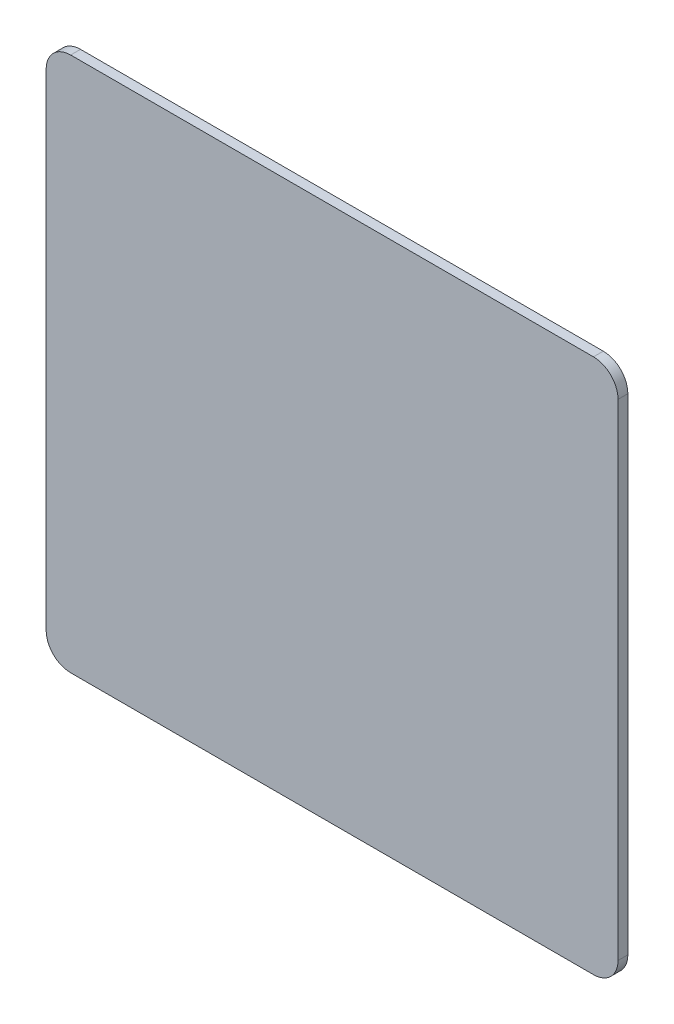
ISO-10303-21;
HEADER;
FILE_DESCRIPTION(('STEP AP214'),'2;1');
FILE_NAME('part.step','',(''),(''),'','','');
FILE_SCHEMA(('AUTOMOTIVE_DESIGN { 1 0 10303 214 1 1 1 1 }'));
ENDSEC;
DATA;
#1=APPLICATION_CONTEXT('core data for automotive mechanical design processes');
#2=APPLICATION_PROTOCOL_DEFINITION('international standard','automotive_design',2000,#1);
#3=PRODUCT_CONTEXT('',#1,'mechanical');
#4=PRODUCT('Part','Part','',(#3));
#5=PRODUCT_RELATED_PRODUCT_CATEGORY('part','',(#4));
#6=PRODUCT_DEFINITION_FORMATION('','',#4);
#7=PRODUCT_DEFINITION_CONTEXT('part definition',#1,'design');
#8=PRODUCT_DEFINITION('design','',#6,#7);
#9=PRODUCT_DEFINITION_SHAPE('','',#8);
#10=(LENGTH_UNIT() NAMED_UNIT(*) SI_UNIT(.MILLI.,.METRE.));
#11=(NAMED_UNIT(*) PLANE_ANGLE_UNIT() SI_UNIT($,.RADIAN.));
#12=(NAMED_UNIT(*) SI_UNIT($,.STERADIAN.) SOLID_ANGLE_UNIT());
#13=UNCERTAINTY_MEASURE_WITH_UNIT(LENGTH_MEASURE(1.E-05),#10,'distance_accuracy_value','');
#14=(GEOMETRIC_REPRESENTATION_CONTEXT(3) GLOBAL_UNCERTAINTY_ASSIGNED_CONTEXT((#13)) GLOBAL_UNIT_ASSIGNED_CONTEXT((#10,
#11,#12)) REPRESENTATION_CONTEXT('',''));
#15=CARTESIAN_POINT('',(0.,0.,0.));
#16=DIRECTION('',(0.,0.,1.));
#17=DIRECTION('',(1.,0.,0.));
#18=AXIS2_PLACEMENT_3D('',#15,#16,#17);
#19=CARTESIAN_POINT('',(23.3,-21.8,0.8));
#20=DIRECTION('',(-1.,0.,0.));
#21=DIRECTION('',(0.,0.,1.));
#22=AXIS2_PLACEMENT_3D('',#19,#20,#21);
#23=PLANE('',#22);
#24=DIRECTION('',(0.,1.,0.));
#25=VECTOR('',#24,1.);
#26=CARTESIAN_POINT('',(23.3,-21.8,0.));
#27=LINE('',#26,#25);
#28=CARTESIAN_POINT('',(23.3,-19.8,0.));
#29=VERTEX_POINT('',#28);
#30=CARTESIAN_POINT('',(23.3,19.8,0.));
#31=VERTEX_POINT('',#30);
#32=EDGE_CURVE('E130',#29,#31,#27,.T.);
#33=ORIENTED_EDGE('',*,*,#32,.T.);
#34=DIRECTION('',(0.,0.,-1.));
#35=VECTOR('',#34,1.);
#36=CARTESIAN_POINT('',(23.3,19.8,0.8));
#37=LINE('',#36,#35);
#38=CARTESIAN_POINT('',(23.3,19.8,0.8));
#39=VERTEX_POINT('',#38);
#40=EDGE_CURVE('E152',#31,#39,#37,.F.);
#41=ORIENTED_EDGE('',*,*,#40,.T.);
#42=DIRECTION('',(0.,1.,0.));
#43=VECTOR('',#42,1.);
#44=CARTESIAN_POINT('',(23.3,-21.8,0.8));
#45=LINE('',#44,#43);
#46=CARTESIAN_POINT('',(23.3,-19.8,0.8));
#47=VERTEX_POINT('',#46);
#48=EDGE_CURVE('E128',#47,#39,#45,.T.);
#49=ORIENTED_EDGE('',*,*,#48,.F.);
#50=DIRECTION('',(0.,0.,-1.));
#51=VECTOR('',#50,1.);
#52=CARTESIAN_POINT('',(23.3,-19.8,0.8));
#53=LINE('',#52,#51);
#54=EDGE_CURVE('E149',#47,#29,#53,.T.);
#55=ORIENTED_EDGE('',*,*,#54,.T.);
#56=EDGE_LOOP('',(#33,#41,#49,#55));
#57=FACE_BOUND('',#56,.T.);
#58=ADVANCED_FACE('F33',(#57),#23,.F.);
#59=CARTESIAN_POINT('',(-23.3,21.8,0.8));
#60=DIRECTION('',(0.,-1.,0.));
#61=DIRECTION('',(0.,0.,-1.));
#62=AXIS2_PLACEMENT_3D('',#59,#60,#61);
#63=PLANE('',#62);
#64=DIRECTION('',(-1.,0.,0.));
#65=VECTOR('',#64,1.);
#66=CARTESIAN_POINT('',(-23.3,21.8,0.));
#67=LINE('',#66,#65);
#68=CARTESIAN_POINT('',(21.3,21.8,0.));
#69=VERTEX_POINT('',#68);
#70=CARTESIAN_POINT('',(-21.3,21.8,0.));
#71=VERTEX_POINT('',#70);
#72=EDGE_CURVE('E126',#69,#71,#67,.T.);
#73=ORIENTED_EDGE('',*,*,#72,.T.);
#74=DIRECTION('',(0.,0.,-1.));
#75=VECTOR('',#74,1.);
#76=CARTESIAN_POINT('',(-21.3,21.8,0.8));
#77=LINE('',#76,#75);
#78=CARTESIAN_POINT('',(-21.3,21.8,0.8));
#79=VERTEX_POINT('',#78);
#80=EDGE_CURVE('E104',#71,#79,#77,.F.);
#81=ORIENTED_EDGE('',*,*,#80,.T.);
#82=DIRECTION('',(-1.,0.,0.));
#83=VECTOR('',#82,1.);
#84=CARTESIAN_POINT('',(-23.3,21.8,0.8));
#85=LINE('',#84,#83);
#86=CARTESIAN_POINT('',(21.3,21.8,0.8));
#87=VERTEX_POINT('',#86);
#88=EDGE_CURVE('E166',#87,#79,#85,.T.);
#89=ORIENTED_EDGE('',*,*,#88,.F.);
#90=DIRECTION('',(0.,0.,-1.));
#91=VECTOR('',#90,1.);
#92=CARTESIAN_POINT('',(21.3,21.8,0.8));
#93=LINE('',#92,#91);
#94=EDGE_CURVE('E109',#87,#69,#93,.T.);
#95=ORIENTED_EDGE('',*,*,#94,.T.);
#96=EDGE_LOOP('',(#73,#81,#89,#95));
#97=FACE_BOUND('',#96,.T.);
#98=ADVANCED_FACE('F171',(#97),#63,.F.);
#99=CARTESIAN_POINT('',(-23.3,-21.8,0.8));
#100=DIRECTION('',(1.,0.,0.));
#101=DIRECTION('',(0.,0.,-1.));
#102=AXIS2_PLACEMENT_3D('',#99,#100,#101);
#103=PLANE('',#102);
#104=DIRECTION('',(0.,-1.,0.));
#105=VECTOR('',#104,1.);
#106=CARTESIAN_POINT('',(-23.3,-21.8,0.8));
#107=LINE('',#106,#105);
#108=CARTESIAN_POINT('',(-23.3,19.8,0.8));
#109=VERTEX_POINT('',#108);
#110=CARTESIAN_POINT('',(-23.3,-19.8,0.8));
#111=VERTEX_POINT('',#110);
#112=EDGE_CURVE('E118',#109,#111,#107,.T.);
#113=ORIENTED_EDGE('',*,*,#112,.F.);
#114=DIRECTION('',(0.,0.,-1.));
#115=VECTOR('',#114,1.);
#116=CARTESIAN_POINT('',(-23.3,19.8,0.8));
#117=LINE('',#116,#115);
#118=CARTESIAN_POINT('',(-23.3,19.8,0.));
#119=VERTEX_POINT('',#118);
#120=EDGE_CURVE('E103',#109,#119,#117,.T.);
#121=ORIENTED_EDGE('',*,*,#120,.T.);
#122=DIRECTION('',(0.,-1.,0.));
#123=VECTOR('',#122,1.);
#124=CARTESIAN_POINT('',(-23.3,-21.8,0.));
#125=LINE('',#124,#123);
#126=CARTESIAN_POINT('',(-23.3,-19.8,0.));
#127=VERTEX_POINT('',#126);
#128=EDGE_CURVE('E116',#119,#127,#125,.T.);
#129=ORIENTED_EDGE('',*,*,#128,.T.);
#130=DIRECTION('',(0.,0.,-1.));
#131=VECTOR('',#130,1.);
#132=CARTESIAN_POINT('',(-23.3,-19.8,0.8));
#133=LINE('',#132,#131);
#134=EDGE_CURVE('E120',#127,#111,#133,.F.);
#135=ORIENTED_EDGE('',*,*,#134,.T.);
#136=EDGE_LOOP('',(#113,#121,#129,#135));
#137=FACE_BOUND('',#136,.T.);
#138=ADVANCED_FACE('F115',(#137),#103,.F.);
#139=CARTESIAN_POINT('',(-23.3,-21.8,0.8));
#140=DIRECTION('',(0.,1.,0.));
#141=DIRECTION('',(0.,0.,1.));
#142=AXIS2_PLACEMENT_3D('',#139,#140,#141);
#143=PLANE('',#142);
#144=DIRECTION('',(1.,0.,0.));
#145=VECTOR('',#144,1.);
#146=CARTESIAN_POINT('',(-23.3,-21.8,0.8));
#147=LINE('',#146,#145);
#148=CARTESIAN_POINT('',(-21.3,-21.8,0.8));
#149=VERTEX_POINT('',#148);
#150=CARTESIAN_POINT('',(21.3,-21.8,0.8));
#151=VERTEX_POINT('',#150);
#152=EDGE_CURVE('E134',#149,#151,#147,.T.);
#153=ORIENTED_EDGE('',*,*,#152,.F.);
#154=DIRECTION('',(0.,0.,-1.));
#155=VECTOR('',#154,1.);
#156=CARTESIAN_POINT('',(-21.3,-21.8,0.8));
#157=LINE('',#156,#155);
#158=CARTESIAN_POINT('',(-21.3,-21.8,0.));
#159=VERTEX_POINT('',#158);
#160=EDGE_CURVE('E11',#149,#159,#157,.T.);
#161=ORIENTED_EDGE('',*,*,#160,.T.);
#162=DIRECTION('',(1.,0.,0.));
#163=VECTOR('',#162,1.);
#164=CARTESIAN_POINT('',(-23.3,-21.8,0.));
#165=LINE('',#164,#163);
#166=CARTESIAN_POINT('',(21.3,-21.8,0.));
#167=VERTEX_POINT('',#166);
#168=EDGE_CURVE('E125',#159,#167,#165,.T.);
#169=ORIENTED_EDGE('',*,*,#168,.T.);
#170=DIRECTION('',(0.,0.,-1.));
#171=VECTOR('',#170,1.);
#172=CARTESIAN_POINT('',(21.3,-21.8,0.8));
#173=LINE('',#172,#171);
#174=EDGE_CURVE('E41',#167,#151,#173,.F.);
#175=ORIENTED_EDGE('',*,*,#174,.T.);
#176=EDGE_LOOP('',(#153,#161,#169,#175));
#177=FACE_BOUND('',#176,.T.);
#178=ADVANCED_FACE('F178',(#177),#143,.F.);
#179=CARTESIAN_POINT('',(0.,0.,0.8));
#180=DIRECTION('',(0.,0.,-1.));
#181=DIRECTION('',(-1.,0.,0.));
#182=AXIS2_PLACEMENT_3D('',#179,#180,#181);
#183=PLANE('',#182);
#184=ORIENTED_EDGE('',*,*,#88,.T.);
#185=CARTESIAN_POINT('',(-21.3,19.8,0.8));
#186=DIRECTION('',(0.,0.,-1.));
#187=DIRECTION('',(-1.,0.,0.));
#188=AXIS2_PLACEMENT_3D('',#185,#186,#187);
#189=CIRCLE('',#188,2.);
#190=EDGE_CURVE('E147',#79,#109,#189,.F.);
#191=ORIENTED_EDGE('',*,*,#190,.T.);
#192=ORIENTED_EDGE('',*,*,#112,.T.);
#193=CARTESIAN_POINT('',(-21.3,-19.8,0.8));
#194=DIRECTION('',(0.,0.,-1.));
#195=DIRECTION('',(-1.,0.,0.));
#196=AXIS2_PLACEMENT_3D('',#193,#194,#195);
#197=CIRCLE('',#196,2.);
#198=EDGE_CURVE('E54',#111,#149,#197,.F.);
#199=ORIENTED_EDGE('',*,*,#198,.T.);
#200=ORIENTED_EDGE('',*,*,#152,.T.);
#201=CARTESIAN_POINT('',(21.3,-19.8,0.8));
#202=DIRECTION('',(0.,0.,-1.));
#203=DIRECTION('',(-1.,0.,0.));
#204=AXIS2_PLACEMENT_3D('',#201,#202,#203);
#205=CIRCLE('',#204,2.);
#206=EDGE_CURVE('E142',#151,#47,#205,.F.);
#207=ORIENTED_EDGE('',*,*,#206,.T.);
#208=ORIENTED_EDGE('',*,*,#48,.T.);
#209=CARTESIAN_POINT('',(21.3,19.8,0.8));
#210=DIRECTION('',(0.,0.,-1.));
#211=DIRECTION('',(-1.,0.,0.));
#212=AXIS2_PLACEMENT_3D('',#209,#210,#211);
#213=CIRCLE('',#212,2.);
#214=EDGE_CURVE('E145',#39,#87,#213,.F.);
#215=ORIENTED_EDGE('',*,*,#214,.T.);
#216=EDGE_LOOP('',(#184,#191,#192,#199,#200,#207,#208,#215));
#217=FACE_BOUND('',#216,.T.);
#218=ADVANCED_FACE('F163',(#217),#183,.F.);
#219=CARTESIAN_POINT('',(0.,0.,0.));
#220=DIRECTION('',(0.,0.,-1.));
#221=DIRECTION('',(-1.,0.,0.));
#222=AXIS2_PLACEMENT_3D('',#219,#220,#221);
#223=PLANE('',#222);
#224=ORIENTED_EDGE('',*,*,#128,.F.);
#225=CARTESIAN_POINT('',(-21.3,19.8,0.));
#226=DIRECTION('',(0.,0.,-1.));
#227=DIRECTION('',(-1.,0.,0.));
#228=AXIS2_PLACEMENT_3D('',#225,#226,#227);
#229=CIRCLE('',#228,2.);
#230=EDGE_CURVE('E99',#119,#71,#229,.T.);
#231=ORIENTED_EDGE('',*,*,#230,.T.);
#232=ORIENTED_EDGE('',*,*,#72,.F.);
#233=CARTESIAN_POINT('',(21.3,19.8,0.));
#234=DIRECTION('',(0.,0.,-1.));
#235=DIRECTION('',(-1.,0.,0.));
#236=AXIS2_PLACEMENT_3D('',#233,#234,#235);
#237=CIRCLE('',#236,2.);
#238=EDGE_CURVE('E110',#69,#31,#237,.T.);
#239=ORIENTED_EDGE('',*,*,#238,.T.);
#240=ORIENTED_EDGE('',*,*,#32,.F.);
#241=CARTESIAN_POINT('',(21.3,-19.8,0.));
#242=DIRECTION('',(0.,0.,-1.));
#243=DIRECTION('',(-1.,0.,0.));
#244=AXIS2_PLACEMENT_3D('',#241,#242,#243);
#245=CIRCLE('',#244,2.);
#246=EDGE_CURVE('E119',#29,#167,#245,.T.);
#247=ORIENTED_EDGE('',*,*,#246,.T.);
#248=ORIENTED_EDGE('',*,*,#168,.F.);
#249=CARTESIAN_POINT('',(-21.3,-19.8,0.));
#250=DIRECTION('',(0.,0.,-1.));
#251=DIRECTION('',(-1.,0.,0.));
#252=AXIS2_PLACEMENT_3D('',#249,#250,#251);
#253=CIRCLE('',#252,2.);
#254=EDGE_CURVE('E124',#159,#127,#253,.T.);
#255=ORIENTED_EDGE('',*,*,#254,.T.);
#256=EDGE_LOOP('',(#224,#231,#232,#239,#240,#247,#248,#255));
#257=FACE_BOUND('',#256,.T.);
#258=ADVANCED_FACE('F122',(#257),#223,.T.);
#259=CARTESIAN_POINT('',(-21.3,19.8,0.8));
#260=DIRECTION('',(0.,0.,-1.));
#261=DIRECTION('',(-1.,0.,0.));
#262=AXIS2_PLACEMENT_3D('',#259,#260,#261);
#263=CYLINDRICAL_SURFACE('',#262,2.);
#264=ORIENTED_EDGE('',*,*,#190,.F.);
#265=ORIENTED_EDGE('',*,*,#80,.F.);
#266=ORIENTED_EDGE('',*,*,#230,.F.);
#267=ORIENTED_EDGE('',*,*,#120,.F.);
#268=EDGE_LOOP('',(#264,#265,#266,#267));
#269=FACE_BOUND('',#268,.T.);
#270=ADVANCED_FACE('F102',(#269),#263,.T.);
#271=CARTESIAN_POINT('',(21.3,19.8,0.8));
#272=DIRECTION('',(0.,0.,-1.));
#273=DIRECTION('',(-1.,0.,0.));
#274=AXIS2_PLACEMENT_3D('',#271,#272,#273);
#275=CYLINDRICAL_SURFACE('',#274,2.);
#276=ORIENTED_EDGE('',*,*,#214,.F.);
#277=ORIENTED_EDGE('',*,*,#40,.F.);
#278=ORIENTED_EDGE('',*,*,#238,.F.);
#279=ORIENTED_EDGE('',*,*,#94,.F.);
#280=EDGE_LOOP('',(#276,#277,#278,#279));
#281=FACE_BOUND('',#280,.T.);
#282=ADVANCED_FACE('F169',(#281),#275,.T.);
#283=CARTESIAN_POINT('',(-21.3,-19.8,0.8));
#284=DIRECTION('',(0.,0.,-1.));
#285=DIRECTION('',(-1.,0.,0.));
#286=AXIS2_PLACEMENT_3D('',#283,#284,#285);
#287=CYLINDRICAL_SURFACE('',#286,2.);
#288=ORIENTED_EDGE('',*,*,#198,.F.);
#289=ORIENTED_EDGE('',*,*,#134,.F.);
#290=ORIENTED_EDGE('',*,*,#254,.F.);
#291=ORIENTED_EDGE('',*,*,#160,.F.);
#292=EDGE_LOOP('',(#288,#289,#290,#291));
#293=FACE_BOUND('',#292,.T.);
#294=ADVANCED_FACE('F177',(#293),#287,.T.);
#295=CARTESIAN_POINT('',(21.3,-19.8,0.8));
#296=DIRECTION('',(0.,0.,-1.));
#297=DIRECTION('',(-1.,0.,0.));
#298=AXIS2_PLACEMENT_3D('',#295,#296,#297);
#299=CYLINDRICAL_SURFACE('',#298,2.);
#300=ORIENTED_EDGE('',*,*,#206,.F.);
#301=ORIENTED_EDGE('',*,*,#174,.F.);
#302=ORIENTED_EDGE('',*,*,#246,.F.);
#303=ORIENTED_EDGE('',*,*,#54,.F.);
#304=EDGE_LOOP('',(#300,#301,#302,#303));
#305=FACE_BOUND('',#304,.T.);
#306=ADVANCED_FACE('F35',(#305),#299,.T.);
#307=CLOSED_SHELL('',(#58,#98,#138,#178,#218,#258,#270,#282,#294,#306));
#308=MANIFOLD_SOLID_BREP('B2',#307);
#309=ADVANCED_BREP_SHAPE_REPRESENTATION('',(#18,#308),#14);
#310=SHAPE_DEFINITION_REPRESENTATION(#9,#309);
ENDSEC;
END-ISO-10303-21;
